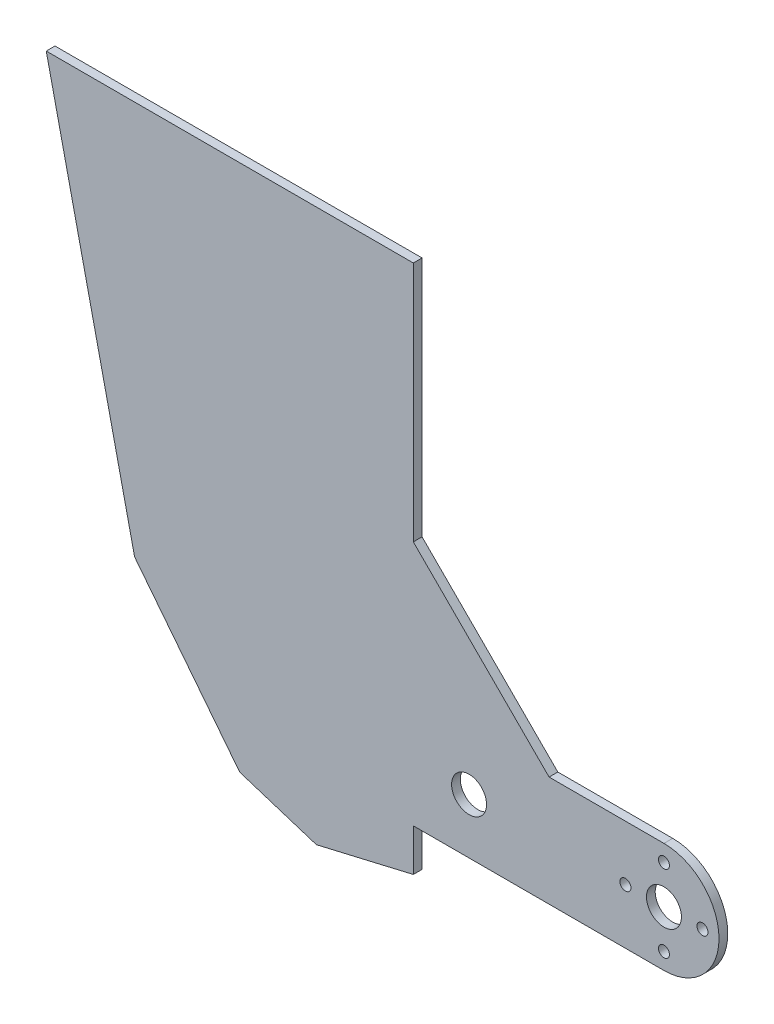
ISO-10303-21;
HEADER;
FILE_DESCRIPTION(('STEP AP214'),'2;1');
FILE_NAME('part.step','',(''),(''),'','','');
FILE_SCHEMA(('AUTOMOTIVE_DESIGN { 1 0 10303 214 1 1 1 1 }'));
ENDSEC;
DATA;
#1=APPLICATION_CONTEXT('core data for automotive mechanical design processes');
#2=APPLICATION_PROTOCOL_DEFINITION('international standard','automotive_design',2000,#1);
#3=PRODUCT_CONTEXT('',#1,'mechanical');
#4=PRODUCT('Part','Part','',(#3));
#5=PRODUCT_RELATED_PRODUCT_CATEGORY('part','',(#4));
#6=PRODUCT_DEFINITION_FORMATION('','',#4);
#7=PRODUCT_DEFINITION_CONTEXT('part definition',#1,'design');
#8=PRODUCT_DEFINITION('design','',#6,#7);
#9=PRODUCT_DEFINITION_SHAPE('','',#8);
#10=(LENGTH_UNIT() NAMED_UNIT(*) SI_UNIT(.MILLI.,.METRE.));
#11=(NAMED_UNIT(*) PLANE_ANGLE_UNIT() SI_UNIT($,.RADIAN.));
#12=(NAMED_UNIT(*) SI_UNIT($,.STERADIAN.) SOLID_ANGLE_UNIT());
#13=UNCERTAINTY_MEASURE_WITH_UNIT(LENGTH_MEASURE(1.E-05),#10,'distance_accuracy_value','');
#14=(GEOMETRIC_REPRESENTATION_CONTEXT(3) GLOBAL_UNCERTAINTY_ASSIGNED_CONTEXT((#13)) GLOBAL_UNIT_ASSIGNED_CONTEXT((#10,
#11,#12)) REPRESENTATION_CONTEXT('',''));
#15=CARTESIAN_POINT('',(0.,0.,0.));
#16=DIRECTION('',(0.,0.,1.));
#17=DIRECTION('',(1.,0.,0.));
#18=AXIS2_PLACEMENT_3D('',#15,#16,#17);
#19=CARTESIAN_POINT('',(-19.4468043224002,-10.,0.));
#20=DIRECTION('',(0.,1.,0.));
#21=DIRECTION('',(-1.,0.,0.));
#22=AXIS2_PLACEMENT_3D('',#19,#20,#21);
#23=PLANE('',#22);
#24=DIRECTION('',(-1.,0.,0.));
#25=VECTOR('',#24,1.);
#26=CARTESIAN_POINT('',(-19.4468043224002,-10.,1.58749999999998));
#27=LINE('',#26,#25);
#28=CARTESIAN_POINT('',(0.,-10.,1.5875));
#29=VERTEX_POINT('',#28);
#30=CARTESIAN_POINT('',(-45.5281085642321,-9.99999999999997,1.58749999999969));
#31=VERTEX_POINT('',#30);
#32=EDGE_CURVE('E140',#29,#31,#27,.T.);
#33=ORIENTED_EDGE('',*,*,#32,.T.);
#34=DIRECTION('',(0.,0.,-1.));
#35=VECTOR('',#34,1.);
#36=CARTESIAN_POINT('',(-45.5281085642321,-9.99999999999999,-8.43075609324728E-13));
#37=LINE('',#36,#35);
#38=CARTESIAN_POINT('',(-45.5281085642321,-9.99999999999997,-3.08780778723872E-13));
#39=VERTEX_POINT('',#38);
#40=EDGE_CURVE('E196',#31,#39,#37,.T.);
#41=ORIENTED_EDGE('',*,*,#40,.T.);
#42=DIRECTION('',(-1.,0.,0.));
#43=VECTOR('',#42,1.);
#44=CARTESIAN_POINT('',(-19.4468043224002,-10.,0.));
#45=LINE('',#44,#43);
#46=CARTESIAN_POINT('',(0.,-10.,0.));
#47=VERTEX_POINT('',#46);
#48=EDGE_CURVE('E60',#47,#39,#45,.T.);
#49=ORIENTED_EDGE('',*,*,#48,.F.);
#50=DIRECTION('',(0.,0.,-1.));
#51=VECTOR('',#50,1.);
#52=CARTESIAN_POINT('',(0.,-10.,1.5875));
#53=LINE('',#52,#51);
#54=EDGE_CURVE('E154',#29,#47,#53,.T.);
#55=ORIENTED_EDGE('',*,*,#54,.F.);
#56=EDGE_LOOP('',(#33,#41,#49,#55));
#57=FACE_BOUND('',#56,.T.);
#58=ADVANCED_FACE('F51',(#57),#23,.F.);
#59=CARTESIAN_POINT('',(-15.9543043224002,10.,0.));
#60=DIRECTION('',(0.,-1.,0.));
#61=DIRECTION('',(1.,0.,0.));
#62=AXIS2_PLACEMENT_3D('',#59,#60,#61);
#63=PLANE('',#62);
#64=DIRECTION('',(1.,0.,0.));
#65=VECTOR('',#64,1.);
#66=CARTESIAN_POINT('',(-15.9543043224002,10.,0.));
#67=LINE('',#66,#65);
#68=CARTESIAN_POINT('',(-20.8647085642318,10.,0.));
#69=VERTEX_POINT('',#68);
#70=CARTESIAN_POINT('',(0.,10.,0.));
#71=VERTEX_POINT('',#70);
#72=EDGE_CURVE('E12',#69,#71,#67,.T.);
#73=ORIENTED_EDGE('',*,*,#72,.F.);
#74=DIRECTION('',(0.,0.,-1.));
#75=VECTOR('',#74,1.);
#76=CARTESIAN_POINT('',(-20.8647085642321,10.,1.58749999999997));
#77=LINE('',#76,#75);
#78=CARTESIAN_POINT('',(-20.8647085642321,10.,1.58749999999997));
#79=VERTEX_POINT('',#78);
#80=EDGE_CURVE('E205',#79,#69,#77,.T.);
#81=ORIENTED_EDGE('',*,*,#80,.F.);
#82=DIRECTION('',(1.,0.,0.));
#83=VECTOR('',#82,1.);
#84=CARTESIAN_POINT('',(-15.9543043224002,10.,1.58750000000001));
#85=LINE('',#84,#83);
#86=CARTESIAN_POINT('',(0.,10.,1.5875));
#87=VERTEX_POINT('',#86);
#88=EDGE_CURVE('E55',#79,#87,#85,.T.);
#89=ORIENTED_EDGE('',*,*,#88,.T.);
#90=DIRECTION('',(0.,0.,-1.));
#91=VECTOR('',#90,1.);
#92=CARTESIAN_POINT('',(0.,10.,1.5875));
#93=LINE('',#92,#91);
#94=EDGE_CURVE('E153',#87,#71,#93,.T.);
#95=ORIENTED_EDGE('',*,*,#94,.T.);
#96=EDGE_LOOP('',(#73,#81,#89,#95));
#97=FACE_BOUND('',#96,.T.);
#98=ADVANCED_FACE('F156',(#97),#63,.F.);
#99=CARTESIAN_POINT('',(0.,0.,0.));
#100=DIRECTION('',(0.,0.,1.));
#101=DIRECTION('',(1.,0.,0.));
#102=AXIS2_PLACEMENT_3D('',#99,#100,#101);
#103=PLANE('',#102);
#104=ORIENTED_EDGE('',*,*,#48,.T.);
#105=DIRECTION('',(0.,-1.,0.));
#106=VECTOR('',#105,1.);
#107=CARTESIAN_POINT('',(-45.5281085642321,78.539500137849,-3.08780778723872E-13));
#108=LINE('',#107,#106);
#109=CARTESIAN_POINT('',(-45.5281085642321,-17.6593029069209,-3.08780778723872E-13));
#110=VERTEX_POINT('',#109);
#111=EDGE_CURVE('E201',#39,#110,#108,.T.);
#112=ORIENTED_EDGE('',*,*,#111,.T.);
#113=DIRECTION('',(0.973731027050495,0.227701310842049,0.));
#114=VECTOR('',#113,1.);
#115=CARTESIAN_POINT('',(-45.5281085642321,-17.6593029069209,-3.08780778723872E-13));
#116=LINE('',#115,#114);
#117=CARTESIAN_POINT('',(-63.1309686848134,-21.7756288867623,-4.30211422042248E-13));
#118=VERTEX_POINT('',#117);
#119=EDGE_CURVE('E240',#118,#110,#116,.T.);
#120=ORIENTED_EDGE('',*,*,#119,.F.);
#121=DIRECTION('',(0.952640239499657,-0.304099612110958,0.));
#122=VECTOR('',#121,1.);
#123=CARTESIAN_POINT('',(-63.1309686848134,-21.7756288867623,-4.30211422042248E-13));
#124=LINE('',#123,#122);
#125=CARTESIAN_POINT('',(-77.0560680373887,-17.3304909048219,-5.27355936696949E-13));
#126=VERTEX_POINT('',#125);
#127=EDGE_CURVE('E233',#126,#118,#124,.T.);
#128=ORIENTED_EDGE('',*,*,#127,.F.);
#129=DIRECTION('',(0.617609018579336,-0.786485282868961,0.));
#130=VECTOR('',#129,1.);
#131=CARTESIAN_POINT('',(-77.0560680373887,-17.3304909048219,-5.27355936696949E-13));
#132=LINE('',#131,#130);
#133=CARTESIAN_POINT('',(-96.1560785012309,6.99214150590516,-6.6266436782314E-13));
#134=VERTEX_POINT('',#133);
#135=EDGE_CURVE('E226',#134,#126,#132,.T.);
#136=ORIENTED_EDGE('',*,*,#135,.F.);
#137=DIRECTION('',(0.218848493217735,-0.975758851877003,0.));
#138=VECTOR('',#137,1.);
#139=CARTESIAN_POINT('',(-96.1560785012309,6.99214150590516,-6.6266436782314E-13));
#140=LINE('',#139,#138);
#141=CARTESIAN_POINT('',(-112.203108564232,78.539500137849,-7.73686670285656E-13));
#142=VERTEX_POINT('',#141);
#143=EDGE_CURVE('E219',#142,#134,#140,.T.);
#144=ORIENTED_EDGE('',*,*,#143,.F.);
#145=DIRECTION('',(1.,0.,0.));
#146=VECTOR('',#145,1.);
#147=CARTESIAN_POINT('',(-45.5281085642321,78.539500137849,-3.08780778723872E-13));
#148=LINE('',#147,#146);
#149=CARTESIAN_POINT('',(-45.5281085642321,78.539500137849,-3.08780778723872E-13));
#150=VERTEX_POINT('',#149);
#151=EDGE_CURVE('E200',#142,#150,#148,.T.);
#152=ORIENTED_EDGE('',*,*,#151,.T.);
#153=CARTESIAN_POINT('',(-45.5281085642321,34.6634000000001,-3.7470027081099E-13));
#154=VERTEX_POINT('',#153);
#155=EDGE_CURVE('E198',#150,#154,#108,.T.);
#156=ORIENTED_EDGE('',*,*,#155,.T.);
#157=DIRECTION('',(0.707106781186547,-0.707106781186548,0.));
#158=VECTOR('',#157,1.);
#159=CARTESIAN_POINT('',(-20.8647085642321,10.,0.));
#160=LINE('',#159,#158);
#161=EDGE_CURVE('E148',#154,#69,#160,.T.);
#162=ORIENTED_EDGE('',*,*,#161,.T.);
#163=ORIENTED_EDGE('',*,*,#72,.T.);
#164=CARTESIAN_POINT('',(0.,0.,0.));
#165=DIRECTION('',(0.,0.,1.));
#166=DIRECTION('',(1.,0.,0.));
#167=AXIS2_PLACEMENT_3D('',#164,#165,#166);
#168=CIRCLE('',#167,10.);
#169=EDGE_CURVE('E145',#47,#71,#168,.T.);
#170=ORIENTED_EDGE('',*,*,#169,.F.);
#171=EDGE_LOOP('',(#104,#112,#120,#128,#136,#144,#152,#156,#162,#163,#170));
#172=FACE_BOUND('',#171,.T.);
#173=CARTESIAN_POINT('',(-35.4011086448005,0.,-2.35922392732846E-13));
#174=DIRECTION('',(0.,0.,-1.));
#175=DIRECTION('',(-1.,0.,0.));
#176=AXIS2_PLACEMENT_3D('',#173,#174,#175);
#177=CIRCLE('',#176,3.175);
#178=CARTESIAN_POINT('',(-38.5761086448005,0.,-2.580932992345E-13));
#179=VERTEX_POINT('',#178);
#180=EDGE_CURVE('E161',#179,#179,#177,.T.);
#181=ORIENTED_EDGE('',*,*,#180,.F.);
#182=EDGE_LOOP('',(#181));
#183=FACE_BOUND('',#182,.T.);
#184=CARTESIAN_POINT('',(-6.99999997,0.,0.));
#185=DIRECTION('',(0.,0.,1.));
#186=DIRECTION('',(1.,0.,0.));
#187=AXIS2_PLACEMENT_3D('',#184,#185,#186);
#188=CIRCLE('',#187,1.000000032);
#189=CARTESIAN_POINT('',(-5.999999938,0.,0.));
#190=VERTEX_POINT('',#189);
#191=EDGE_CURVE('E175',#190,#190,#188,.T.);
#192=ORIENTED_EDGE('',*,*,#191,.T.);
#193=EDGE_LOOP('',(#192));
#194=FACE_BOUND('',#193,.T.);
#195=CARTESIAN_POINT('',(0.,-6.99999997,0.));
#196=DIRECTION('',(0.,0.,1.));
#197=DIRECTION('',(1.,0.,0.));
#198=AXIS2_PLACEMENT_3D('',#195,#196,#197);
#199=CIRCLE('',#198,1.000000032);
#200=CARTESIAN_POINT('',(1.000000032,-6.99999997,0.));
#201=VERTEX_POINT('',#200);
#202=EDGE_CURVE('E172',#201,#201,#199,.T.);
#203=ORIENTED_EDGE('',*,*,#202,.T.);
#204=EDGE_LOOP('',(#203));
#205=FACE_BOUND('',#204,.T.);
#206=CARTESIAN_POINT('',(6.99999997,0.,0.));
#207=DIRECTION('',(0.,0.,1.));
#208=DIRECTION('',(1.,0.,0.));
#209=AXIS2_PLACEMENT_3D('',#206,#207,#208);
#210=CIRCLE('',#209,1.000000032);
#211=CARTESIAN_POINT('',(8.000000002,0.,0.));
#212=VERTEX_POINT('',#211);
#213=EDGE_CURVE('E169',#212,#212,#210,.T.);
#214=ORIENTED_EDGE('',*,*,#213,.T.);
#215=EDGE_LOOP('',(#214));
#216=FACE_BOUND('',#215,.T.);
#217=CARTESIAN_POINT('',(0.,6.99999997,0.));
#218=DIRECTION('',(0.,0.,1.));
#219=DIRECTION('',(1.,0.,0.));
#220=AXIS2_PLACEMENT_3D('',#217,#218,#219);
#221=CIRCLE('',#220,1.000000032);
#222=CARTESIAN_POINT('',(1.000000032,6.99999997,0.));
#223=VERTEX_POINT('',#222);
#224=EDGE_CURVE('E164',#223,#223,#221,.T.);
#225=ORIENTED_EDGE('',*,*,#224,.T.);
#226=EDGE_LOOP('',(#225));
#227=FACE_BOUND('',#226,.T.);
#228=CARTESIAN_POINT('',(0.,0.,0.));
#229=DIRECTION('',(0.,0.,1.));
#230=DIRECTION('',(1.,0.,0.));
#231=AXIS2_PLACEMENT_3D('',#228,#229,#230);
#232=CIRCLE('',#231,3.175);
#233=CARTESIAN_POINT('',(3.175,0.,0.));
#234=VERTEX_POINT('',#233);
#235=EDGE_CURVE('E158',#234,#234,#232,.T.);
#236=ORIENTED_EDGE('',*,*,#235,.T.);
#237=EDGE_LOOP('',(#236));
#238=FACE_BOUND('',#237,.T.);
#239=ADVANCED_FACE('F53',(#172,#183,#194,#205,#216,#227,#238),#103,.F.);
#240=CARTESIAN_POINT('',(-14.3668043224002,0.,1.58750000000002));
#241=DIRECTION('',(0.,0.,1.));
#242=DIRECTION('',(1.,0.,0.));
#243=AXIS2_PLACEMENT_3D('',#240,#241,#242);
#244=PLANE('',#243);
#245=ORIENTED_EDGE('',*,*,#88,.F.);
#246=DIRECTION('',(-0.707106781186547,0.707106781186548,0.));
#247=VECTOR('',#246,1.);
#248=CARTESIAN_POINT('',(-20.8647085642321,10.,1.58749999999997));
#249=LINE('',#248,#247);
#250=CARTESIAN_POINT('',(-45.5281085642321,34.6634000000001,1.58749999999962));
#251=VERTEX_POINT('',#250);
#252=EDGE_CURVE('E208',#79,#251,#249,.T.);
#253=ORIENTED_EDGE('',*,*,#252,.T.);
#254=DIRECTION('',(0.,-1.,0.));
#255=VECTOR('',#254,1.);
#256=CARTESIAN_POINT('',(-45.5281085642321,78.539500137849,1.58749999999969));
#257=LINE('',#256,#255);
#258=CARTESIAN_POINT('',(-45.5281085642321,78.539500137849,1.58749999999969));
#259=VERTEX_POINT('',#258);
#260=EDGE_CURVE('E210',#259,#251,#257,.T.);
#261=ORIENTED_EDGE('',*,*,#260,.F.);
#262=DIRECTION('',(1.,0.,0.));
#263=VECTOR('',#262,1.);
#264=CARTESIAN_POINT('',(-45.5281085642321,78.539500137849,1.58749999999969));
#265=LINE('',#264,#263);
#266=CARTESIAN_POINT('',(-112.203108564232,78.539500137849,1.58749999999923));
#267=VERTEX_POINT('',#266);
#268=EDGE_CURVE('E216',#267,#259,#265,.T.);
#269=ORIENTED_EDGE('',*,*,#268,.F.);
#270=DIRECTION('',(-0.218848493217735,0.975758851877003,0.));
#271=VECTOR('',#270,1.);
#272=CARTESIAN_POINT('',(-91.7531143432241,-12.6389338033408,1.58749999999898));
#273=LINE('',#272,#271);
#274=CARTESIAN_POINT('',(-96.1560785012309,6.99214150590516,1.58749999999886));
#275=VERTEX_POINT('',#274);
#276=EDGE_CURVE('E224',#275,#267,#273,.T.);
#277=ORIENTED_EDGE('',*,*,#276,.F.);
#278=DIRECTION('',(-0.617609018579336,0.786485282868961,0.));
#279=VECTOR('',#278,1.);
#280=CARTESIAN_POINT('',(-69.5852824923527,-26.8440548358612,1.58749999999928));
#281=LINE('',#280,#279);
#282=CARTESIAN_POINT('',(-77.0560680373887,-17.3304909048219,1.58749999999911));
#283=VERTEX_POINT('',#282);
#284=EDGE_CURVE('E231',#283,#275,#281,.T.);
#285=ORIENTED_EDGE('',*,*,#284,.F.);
#286=DIRECTION('',(-0.952640239499658,0.304099612110958,0.));
#287=VECTOR('',#286,1.);
#288=CARTESIAN_POINT('',(-44.2738169453696,-27.7951652150767,1.58749999999964));
#289=LINE('',#288,#287);
#290=CARTESIAN_POINT('',(-63.1309686848134,-21.7756288867623,1.58749999999933));
#291=VERTEX_POINT('',#290);
#292=EDGE_CURVE('E238',#291,#283,#289,.T.);
#293=ORIENTED_EDGE('',*,*,#292,.F.);
#294=DIRECTION('',(-0.973731027050496,-0.227701310842049,0.));
#295=VECTOR('',#294,1.);
#296=CARTESIAN_POINT('',(-32.010754531044,-14.4983486526478,1.58749999999981));
#297=LINE('',#296,#295);
#298=CARTESIAN_POINT('',(-45.5281085642321,-17.6593029069209,1.58749999999969));
#299=VERTEX_POINT('',#298);
#300=EDGE_CURVE('E244',#299,#291,#297,.T.);
#301=ORIENTED_EDGE('',*,*,#300,.F.);
#302=EDGE_CURVE('E214',#31,#299,#257,.T.);
#303=ORIENTED_EDGE('',*,*,#302,.F.);
#304=ORIENTED_EDGE('',*,*,#32,.F.);
#305=CARTESIAN_POINT('',(0.,0.,1.5875));
#306=DIRECTION('',(0.,0.,1.));
#307=DIRECTION('',(1.,0.,0.));
#308=AXIS2_PLACEMENT_3D('',#305,#306,#307);
#309=CIRCLE('',#308,10.);
#310=EDGE_CURVE('E178',#29,#87,#309,.T.);
#311=ORIENTED_EDGE('',*,*,#310,.T.);
#312=EDGE_LOOP('',(#245,#253,#261,#269,#277,#285,#293,#301,#303,#304,#311));
#313=FACE_BOUND('',#312,.T.);
#314=CARTESIAN_POINT('',(-35.4011086448005,0.,1.58749999999976));
#315=DIRECTION('',(0.,0.,1.));
#316=DIRECTION('',(1.,0.,0.));
#317=AXIS2_PLACEMENT_3D('',#314,#315,#316);
#318=CIRCLE('',#317,3.175);
#319=CARTESIAN_POINT('',(-32.2261086448005,0.,1.58749999999981));
#320=VERTEX_POINT('',#319);
#321=EDGE_CURVE('E157',#320,#320,#318,.T.);
#322=ORIENTED_EDGE('',*,*,#321,.F.);
#323=EDGE_LOOP('',(#322));
#324=FACE_BOUND('',#323,.T.);
#325=CARTESIAN_POINT('',(0.,-6.99999997,1.5875));
#326=DIRECTION('',(0.,0.,1.));
#327=DIRECTION('',(1.,0.,0.));
#328=AXIS2_PLACEMENT_3D('',#325,#326,#327);
#329=CIRCLE('',#328,1.000000032);
#330=CARTESIAN_POINT('',(1.000000032,-6.99999997,1.5875));
#331=VERTEX_POINT('',#330);
#332=EDGE_CURVE('E180',#331,#331,#329,.T.);
#333=ORIENTED_EDGE('',*,*,#332,.F.);
#334=EDGE_LOOP('',(#333));
#335=FACE_BOUND('',#334,.T.);
#336=CARTESIAN_POINT('',(0.,6.99999997,1.5875));
#337=DIRECTION('',(0.,0.,1.));
#338=DIRECTION('',(1.,0.,0.));
#339=AXIS2_PLACEMENT_3D('',#336,#337,#338);
#340=CIRCLE('',#339,1.000000032);
#341=CARTESIAN_POINT('',(1.000000032,6.99999997,1.5875));
#342=VERTEX_POINT('',#341);
#343=EDGE_CURVE('E183',#342,#342,#340,.T.);
#344=ORIENTED_EDGE('',*,*,#343,.F.);
#345=EDGE_LOOP('',(#344));
#346=FACE_BOUND('',#345,.T.);
#347=CARTESIAN_POINT('',(0.,0.,1.5875));
#348=DIRECTION('',(0.,0.,1.));
#349=DIRECTION('',(1.,0.,0.));
#350=AXIS2_PLACEMENT_3D('',#347,#348,#349);
#351=CIRCLE('',#350,3.175);
#352=CARTESIAN_POINT('',(3.175,0.,1.5875));
#353=VERTEX_POINT('',#352);
#354=EDGE_CURVE('E186',#353,#353,#351,.T.);
#355=ORIENTED_EDGE('',*,*,#354,.F.);
#356=EDGE_LOOP('',(#355));
#357=FACE_BOUND('',#356,.T.);
#358=CARTESIAN_POINT('',(6.99999997,0.,1.5875));
#359=DIRECTION('',(0.,0.,1.));
#360=DIRECTION('',(1.,0.,0.));
#361=AXIS2_PLACEMENT_3D('',#358,#359,#360);
#362=CIRCLE('',#361,1.000000032);
#363=CARTESIAN_POINT('',(8.000000002,0.,1.5875));
#364=VERTEX_POINT('',#363);
#365=EDGE_CURVE('E189',#364,#364,#362,.T.);
#366=ORIENTED_EDGE('',*,*,#365,.F.);
#367=EDGE_LOOP('',(#366));
#368=FACE_BOUND('',#367,.T.);
#369=CARTESIAN_POINT('',(-6.99999997,0.,1.5875));
#370=DIRECTION('',(0.,0.,1.));
#371=DIRECTION('',(1.,0.,0.));
#372=AXIS2_PLACEMENT_3D('',#369,#370,#371);
#373=CIRCLE('',#372,1.000000032);
#374=CARTESIAN_POINT('',(-5.999999938,0.,1.5875));
#375=VERTEX_POINT('',#374);
#376=EDGE_CURVE('E192',#375,#375,#373,.T.);
#377=ORIENTED_EDGE('',*,*,#376,.F.);
#378=EDGE_LOOP('',(#377));
#379=FACE_BOUND('',#378,.T.);
#380=ADVANCED_FACE('F258',(#313,#324,#335,#346,#357,#368,#379),#244,.T.);
#381=CARTESIAN_POINT('',(-35.4011086448005,0.,6.66749999999988));
#382=DIRECTION('',(0.,0.,-1.));
#383=DIRECTION('',(-1.,0.,0.));
#384=AXIS2_PLACEMENT_3D('',#381,#382,#383);
#385=CYLINDRICAL_SURFACE('',#384,3.175);
#386=ORIENTED_EDGE('',*,*,#321,.T.);
#387=EDGE_LOOP('',(#386));
#388=FACE_BOUND('',#387,.T.);
#389=ORIENTED_EDGE('',*,*,#180,.T.);
#390=EDGE_LOOP('',(#389));
#391=FACE_BOUND('',#390,.T.);
#392=ADVANCED_FACE('F299',(#388,#391),#385,.F.);
#393=CARTESIAN_POINT('',(-45.5281085642321,78.539500137849,1.58749999999969));
#394=DIRECTION('',(1.,0.,0.));
#395=DIRECTION('',(0.,0.,-1.));
#396=AXIS2_PLACEMENT_3D('',#393,#394,#395);
#397=PLANE('',#396);
#398=DIRECTION('',(0.,0.,-1.));
#399=VECTOR('',#398,1.);
#400=CARTESIAN_POINT('',(-45.5281085642322,-17.6593029069209,6.66749999999981));
#401=LINE('',#400,#399);
#402=EDGE_CURVE('E246',#299,#110,#401,.T.);
#403=ORIENTED_EDGE('',*,*,#402,.T.);
#404=ORIENTED_EDGE('',*,*,#111,.F.);
#405=ORIENTED_EDGE('',*,*,#40,.F.);
#406=ORIENTED_EDGE('',*,*,#302,.T.);
#407=EDGE_LOOP('',(#403,#404,#405,#406));
#408=FACE_BOUND('',#407,.T.);
#409=ADVANCED_FACE('F255',(#408),#397,.T.);
#410=CARTESIAN_POINT('',(-45.5281085642322,-17.6593029069209,6.66749999999981));
#411=DIRECTION('',(-0.227701310842049,0.973731027050495,0.));
#412=DIRECTION('',(0.973731027050496,0.227701310842049,0.));
#413=AXIS2_PLACEMENT_3D('',#410,#411,#412);
#414=PLANE('',#413);
#415=ORIENTED_EDGE('',*,*,#300,.T.);
#416=DIRECTION('',(0.,0.,-1.));
#417=VECTOR('',#416,1.);
#418=CARTESIAN_POINT('',(-63.1309686848134,-21.7756288867623,6.66749999999968));
#419=LINE('',#418,#417);
#420=EDGE_CURVE('E242',#291,#118,#419,.T.);
#421=ORIENTED_EDGE('',*,*,#420,.T.);
#422=ORIENTED_EDGE('',*,*,#119,.T.);
#423=ORIENTED_EDGE('',*,*,#402,.F.);
#424=EDGE_LOOP('',(#415,#421,#422,#423));
#425=FACE_BOUND('',#424,.T.);
#426=ADVANCED_FACE('F264',(#425),#414,.F.);
#427=CARTESIAN_POINT('',(-63.1309686848134,-21.7756288867623,6.66749999999968));
#428=DIRECTION('',(0.304099612110958,0.952640239499658,0.));
#429=DIRECTION('',(0.952640239499658,-0.304099612110958,0.));
#430=AXIS2_PLACEMENT_3D('',#427,#428,#429);
#431=PLANE('',#430);
#432=ORIENTED_EDGE('',*,*,#292,.T.);
#433=DIRECTION('',(0.,0.,-1.));
#434=VECTOR('',#433,1.);
#435=CARTESIAN_POINT('',(-77.0560680373887,-17.3304909048219,6.66749999999959));
#436=LINE('',#435,#434);
#437=EDGE_CURVE('E236',#283,#126,#436,.T.);
#438=ORIENTED_EDGE('',*,*,#437,.T.);
#439=ORIENTED_EDGE('',*,*,#127,.T.);
#440=ORIENTED_EDGE('',*,*,#420,.F.);
#441=EDGE_LOOP('',(#432,#438,#439,#440));
#442=FACE_BOUND('',#441,.T.);
#443=ADVANCED_FACE('F266',(#442),#431,.F.);
#444=CARTESIAN_POINT('',(-77.0560680373887,-17.3304909048219,6.66749999999959));
#445=DIRECTION('',(0.786485282868961,0.617609018579336,0.));
#446=DIRECTION('',(0.617609018579336,-0.786485282868961,0.));
#447=AXIS2_PLACEMENT_3D('',#444,#445,#446);
#448=PLANE('',#447);
#449=ORIENTED_EDGE('',*,*,#284,.T.);
#450=DIRECTION('',(0.,0.,-1.));
#451=VECTOR('',#450,1.);
#452=CARTESIAN_POINT('',(-96.156078501231,6.99214150590516,6.66749999999945));
#453=LINE('',#452,#451);
#454=EDGE_CURVE('E229',#275,#134,#453,.T.);
#455=ORIENTED_EDGE('',*,*,#454,.T.);
#456=ORIENTED_EDGE('',*,*,#135,.T.);
#457=ORIENTED_EDGE('',*,*,#437,.F.);
#458=EDGE_LOOP('',(#449,#455,#456,#457));
#459=FACE_BOUND('',#458,.T.);
#460=ADVANCED_FACE('F274',(#459),#448,.F.);
#461=CARTESIAN_POINT('',(-96.156078501231,6.99214150590516,6.66749999999945));
#462=DIRECTION('',(0.975758851877003,0.218848493217735,0.));
#463=DIRECTION('',(0.218848493217735,-0.975758851877003,0.));
#464=AXIS2_PLACEMENT_3D('',#461,#462,#463);
#465=PLANE('',#464);
#466=ORIENTED_EDGE('',*,*,#276,.T.);
#467=DIRECTION('',(0.,0.,-1.));
#468=VECTOR('',#467,1.);
#469=CARTESIAN_POINT('',(-112.203108564232,78.539500137849,1.58749999999923));
#470=LINE('',#469,#468);
#471=EDGE_CURVE('E222',#267,#142,#470,.T.);
#472=ORIENTED_EDGE('',*,*,#471,.T.);
#473=ORIENTED_EDGE('',*,*,#143,.T.);
#474=ORIENTED_EDGE('',*,*,#454,.F.);
#475=EDGE_LOOP('',(#466,#472,#473,#474));
#476=FACE_BOUND('',#475,.T.);
#477=ADVANCED_FACE('F278',(#476),#465,.F.);
#478=CARTESIAN_POINT('',(-45.5281085642321,78.539500137849,1.58749999999969));
#479=DIRECTION('',(0.,1.,0.));
#480=DIRECTION('',(0.,0.,-1.));
#481=AXIS2_PLACEMENT_3D('',#478,#479,#480);
#482=PLANE('',#481);
#483=ORIENTED_EDGE('',*,*,#151,.F.);
#484=ORIENTED_EDGE('',*,*,#471,.F.);
#485=ORIENTED_EDGE('',*,*,#268,.T.);
#486=DIRECTION('',(0.,0.,-1.));
#487=VECTOR('',#486,1.);
#488=CARTESIAN_POINT('',(-45.5281085642321,78.539500137849,1.58749999999969));
#489=LINE('',#488,#487);
#490=EDGE_CURVE('E213',#259,#150,#489,.T.);
#491=ORIENTED_EDGE('',*,*,#490,.T.);
#492=EDGE_LOOP('',(#483,#484,#485,#491));
#493=FACE_BOUND('',#492,.T.);
#494=ADVANCED_FACE('F282',(#493),#482,.T.);
#495=DIRECTION('',(0.,0.,1.));
#496=VECTOR('',#495,1.);
#497=CARTESIAN_POINT('',(-45.5281085642316,34.6634000000001,-34.879314774233));
#498=LINE('',#497,#496);
#499=EDGE_CURVE('E75',#154,#251,#498,.T.);
#500=ORIENTED_EDGE('',*,*,#499,.F.);
#501=ORIENTED_EDGE('',*,*,#155,.F.);
#502=ORIENTED_EDGE('',*,*,#490,.F.);
#503=ORIENTED_EDGE('',*,*,#260,.T.);
#504=EDGE_LOOP('',(#500,#501,#502,#503));
#505=FACE_BOUND('',#504,.T.);
#506=ADVANCED_FACE('F285',(#505),#397,.T.);
#507=CARTESIAN_POINT('',(-20.8647085642316,10.,-34.8793147742327));
#508=DIRECTION('',(0.707106781186548,0.707106781186547,0.));
#509=DIRECTION('',(0.707106781186547,-0.707106781186548,0.));
#510=AXIS2_PLACEMENT_3D('',#507,#508,#509);
#511=PLANE('',#510);
#512=ORIENTED_EDGE('',*,*,#161,.F.);
#513=ORIENTED_EDGE('',*,*,#499,.T.);
#514=ORIENTED_EDGE('',*,*,#252,.F.);
#515=ORIENTED_EDGE('',*,*,#80,.T.);
#516=EDGE_LOOP('',(#512,#513,#514,#515));
#517=FACE_BOUND('',#516,.T.);
#518=ADVANCED_FACE('F288',(#517),#511,.T.);
#519=CARTESIAN_POINT('',(0.,0.,1.5875));
#520=DIRECTION('',(0.,0.,-1.));
#521=DIRECTION('',(-1.,0.,0.));
#522=AXIS2_PLACEMENT_3D('',#519,#520,#521);
#523=CYLINDRICAL_SURFACE('',#522,10.);
#524=ORIENTED_EDGE('',*,*,#169,.T.);
#525=ORIENTED_EDGE('',*,*,#94,.F.);
#526=ORIENTED_EDGE('',*,*,#310,.F.);
#527=ORIENTED_EDGE('',*,*,#54,.T.);
#528=EDGE_LOOP('',(#524,#525,#526,#527));
#529=FACE_BOUND('',#528,.T.);
#530=ADVANCED_FACE('F152',(#529),#523,.T.);
#531=CARTESIAN_POINT('',(-6.99999997,0.,1.5875));
#532=DIRECTION('',(0.,0.,-1.));
#533=DIRECTION('',(-1.,0.,0.));
#534=AXIS2_PLACEMENT_3D('',#531,#532,#533);
#535=CYLINDRICAL_SURFACE('',#534,1.000000032);
#536=ORIENTED_EDGE('',*,*,#376,.T.);
#537=EDGE_LOOP('',(#536));
#538=FACE_BOUND('',#537,.T.);
#539=ORIENTED_EDGE('',*,*,#191,.F.);
#540=EDGE_LOOP('',(#539));
#541=FACE_BOUND('',#540,.T.);
#542=ADVANCED_FACE('F358',(#538,#541),#535,.F.);
#543=CARTESIAN_POINT('',(6.99999997,0.,1.5875));
#544=DIRECTION('',(0.,0.,-1.));
#545=DIRECTION('',(-1.,0.,0.));
#546=AXIS2_PLACEMENT_3D('',#543,#544,#545);
#547=CYLINDRICAL_SURFACE('',#546,1.000000032);
#548=ORIENTED_EDGE('',*,*,#365,.T.);
#549=EDGE_LOOP('',(#548));
#550=FACE_BOUND('',#549,.T.);
#551=ORIENTED_EDGE('',*,*,#213,.F.);
#552=EDGE_LOOP('',(#551));
#553=FACE_BOUND('',#552,.T.);
#554=ADVANCED_FACE('F368',(#550,#553),#547,.F.);
#555=CARTESIAN_POINT('',(0.,0.,1.5875));
#556=DIRECTION('',(0.,0.,-1.));
#557=DIRECTION('',(-1.,0.,0.));
#558=AXIS2_PLACEMENT_3D('',#555,#556,#557);
#559=CYLINDRICAL_SURFACE('',#558,3.175);
#560=ORIENTED_EDGE('',*,*,#354,.T.);
#561=EDGE_LOOP('',(#560));
#562=FACE_BOUND('',#561,.T.);
#563=ORIENTED_EDGE('',*,*,#235,.F.);
#564=EDGE_LOOP('',(#563));
#565=FACE_BOUND('',#564,.T.);
#566=ADVANCED_FACE('F379',(#562,#565),#559,.F.);
#567=CARTESIAN_POINT('',(0.,6.99999997,1.5875));
#568=DIRECTION('',(0.,0.,-1.));
#569=DIRECTION('',(-1.,0.,0.));
#570=AXIS2_PLACEMENT_3D('',#567,#568,#569);
#571=CYLINDRICAL_SURFACE('',#570,1.000000032);
#572=ORIENTED_EDGE('',*,*,#343,.T.);
#573=EDGE_LOOP('',(#572));
#574=FACE_BOUND('',#573,.T.);
#575=ORIENTED_EDGE('',*,*,#224,.F.);
#576=EDGE_LOOP('',(#575));
#577=FACE_BOUND('',#576,.T.);
#578=ADVANCED_FACE('F390',(#574,#577),#571,.F.);
#579=CARTESIAN_POINT('',(0.,-6.99999997,1.5875));
#580=DIRECTION('',(0.,0.,-1.));
#581=DIRECTION('',(-1.,0.,0.));
#582=AXIS2_PLACEMENT_3D('',#579,#580,#581);
#583=CYLINDRICAL_SURFACE('',#582,1.000000032);
#584=ORIENTED_EDGE('',*,*,#332,.T.);
#585=EDGE_LOOP('',(#584));
#586=FACE_BOUND('',#585,.T.);
#587=ORIENTED_EDGE('',*,*,#202,.F.);
#588=EDGE_LOOP('',(#587));
#589=FACE_BOUND('',#588,.T.);
#590=ADVANCED_FACE('F401',(#586,#589),#583,.F.);
#591=CLOSED_SHELL('',(#58,#98,#239,#380,#392,#409,#426,#443,#460,#477,#494,#506,#518,#530,#542,
#554,#566,#578,#590));
#592=MANIFOLD_SOLID_BREP('B2',#591);
#593=ADVANCED_BREP_SHAPE_REPRESENTATION('',(#18,#592),#14);
#594=SHAPE_DEFINITION_REPRESENTATION(#9,#593);
ENDSEC;
END-ISO-10303-21;
